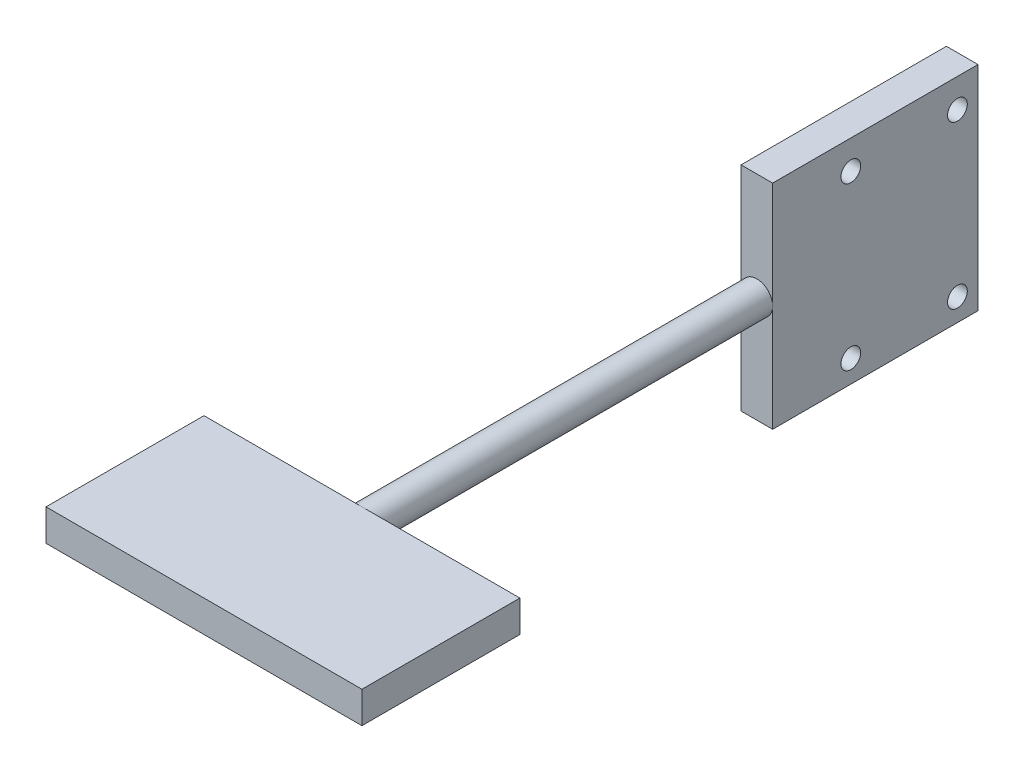
ISO-10303-21;
HEADER;
FILE_DESCRIPTION(('STEP AP214'),'2;1');
FILE_NAME('part.step','',(''),(''),'','','');
FILE_SCHEMA(('AUTOMOTIVE_DESIGN { 1 0 10303 214 1 1 1 1 }'));
ENDSEC;
DATA;
#1=APPLICATION_CONTEXT('core data for automotive mechanical design processes');
#2=APPLICATION_PROTOCOL_DEFINITION('international standard','automotive_design',2000,#1);
#3=PRODUCT_CONTEXT('',#1,'mechanical');
#4=PRODUCT('Part','Part','',(#3));
#5=PRODUCT_RELATED_PRODUCT_CATEGORY('part','',(#4));
#6=PRODUCT_DEFINITION_FORMATION('','',#4);
#7=PRODUCT_DEFINITION_CONTEXT('part definition',#1,'design');
#8=PRODUCT_DEFINITION('design','',#6,#7);
#9=PRODUCT_DEFINITION_SHAPE('','',#8);
#10=(LENGTH_UNIT() NAMED_UNIT(*) SI_UNIT(.MILLI.,.METRE.));
#11=(NAMED_UNIT(*) PLANE_ANGLE_UNIT() SI_UNIT($,.RADIAN.));
#12=(NAMED_UNIT(*) SI_UNIT($,.STERADIAN.) SOLID_ANGLE_UNIT());
#13=UNCERTAINTY_MEASURE_WITH_UNIT(LENGTH_MEASURE(1.E-05),#10,'distance_accuracy_value','');
#14=(GEOMETRIC_REPRESENTATION_CONTEXT(3) GLOBAL_UNCERTAINTY_ASSIGNED_CONTEXT((#13)) GLOBAL_UNIT_ASSIGNED_CONTEXT((#10,
#11,#12)) REPRESENTATION_CONTEXT('',''));
#15=CARTESIAN_POINT('',(0.,0.,0.));
#16=DIRECTION('',(0.,0.,1.));
#17=DIRECTION('',(1.,0.,0.));
#18=AXIS2_PLACEMENT_3D('',#15,#16,#17);
#19=CARTESIAN_POINT('',(-12.8813559322034,4.,-10.1694915254237));
#20=DIRECTION('',(0.,0.,1.));
#21=DIRECTION('',(1.,0.,0.));
#22=AXIS2_PLACEMENT_3D('',#19,#20,#21);
#23=PLANE('',#22);
#24=CARTESIAN_POINT('',(7.1186440677966,2.,-10.1694915254237));
#25=DIRECTION('',(0.,0.,-1.));
#26=DIRECTION('',(-1.,0.,0.));
#27=AXIS2_PLACEMENT_3D('',#24,#25,#26);
#28=CIRCLE('',#27,2.);
#29=CARTESIAN_POINT('',(7.1186440677966,4.,-10.1694915254237));
#30=VERTEX_POINT('',#29);
#31=CARTESIAN_POINT('',(7.1186440677966,0.,-10.1694915254237));
#32=VERTEX_POINT('',#31);
#33=EDGE_CURVE('E52',#30,#32,#28,.T.);
#34=ORIENTED_EDGE('',*,*,#33,.F.);
#35=DIRECTION('',(-1.,0.,0.));
#36=VECTOR('',#35,1.);
#37=CARTESIAN_POINT('',(-12.8813559322034,4.,-10.1694915254237));
#38=LINE('',#37,#36);
#39=CARTESIAN_POINT('',(27.1186440677966,4.,-10.1694915254237));
#40=VERTEX_POINT('',#39);
#41=EDGE_CURVE('E200',#40,#30,#38,.T.);
#42=ORIENTED_EDGE('',*,*,#41,.F.);
#43=DIRECTION('',(0.,-1.,0.));
#44=VECTOR('',#43,1.);
#45=CARTESIAN_POINT('',(27.1186440677966,4.,-10.1694915254237));
#46=LINE('',#45,#44);
#47=CARTESIAN_POINT('',(27.1186440677966,0.,-10.1694915254237));
#48=VERTEX_POINT('',#47);
#49=EDGE_CURVE('E220',#40,#48,#46,.T.);
#50=ORIENTED_EDGE('',*,*,#49,.T.);
#51=DIRECTION('',(-1.,0.,0.));
#52=VECTOR('',#51,1.);
#53=CARTESIAN_POINT('',(-12.8813559322034,0.,-10.1694915254237));
#54=LINE('',#53,#52);
#55=EDGE_CURVE('E193',#48,#32,#54,.T.);
#56=ORIENTED_EDGE('',*,*,#55,.T.);
#57=EDGE_LOOP('',(#34,#42,#50,#56));
#58=FACE_BOUND('',#57,.T.);
#59=ADVANCED_FACE('F41',(#58),#23,.F.);
#60=CARTESIAN_POINT('',(-12.8813559322034,4.,-10.1694915254237));
#61=DIRECTION('',(1.,0.,0.));
#62=DIRECTION('',(0.,0.,-1.));
#63=AXIS2_PLACEMENT_3D('',#60,#61,#62);
#64=PLANE('',#63);
#65=DIRECTION('',(0.,0.,1.));
#66=VECTOR('',#65,1.);
#67=CARTESIAN_POINT('',(-12.8813559322034,0.,-10.1694915254237));
#68=LINE('',#67,#66);
#69=CARTESIAN_POINT('',(-12.8813559322034,0.,-10.1694915254237));
#70=VERTEX_POINT('',#69);
#71=CARTESIAN_POINT('',(-12.8813559322034,0.,9.83050847457626));
#72=VERTEX_POINT('',#71);
#73=EDGE_CURVE('E184',#70,#72,#68,.T.);
#74=ORIENTED_EDGE('',*,*,#73,.T.);
#75=DIRECTION('',(0.,-1.,0.));
#76=VECTOR('',#75,1.);
#77=CARTESIAN_POINT('',(-12.8813559322034,4.,9.83050847457626));
#78=LINE('',#77,#76);
#79=CARTESIAN_POINT('',(-12.8813559322034,4.,9.83050847457626));
#80=VERTEX_POINT('',#79);
#81=EDGE_CURVE('E45',#80,#72,#78,.T.);
#82=ORIENTED_EDGE('',*,*,#81,.F.);
#83=DIRECTION('',(0.,0.,1.));
#84=VECTOR('',#83,1.);
#85=CARTESIAN_POINT('',(-12.8813559322034,4.,-10.1694915254237));
#86=LINE('',#85,#84);
#87=CARTESIAN_POINT('',(-12.8813559322034,4.,-10.1694915254237));
#88=VERTEX_POINT('',#87);
#89=EDGE_CURVE('E188',#88,#80,#86,.T.);
#90=ORIENTED_EDGE('',*,*,#89,.F.);
#91=DIRECTION('',(0.,-1.,0.));
#92=VECTOR('',#91,1.);
#93=CARTESIAN_POINT('',(-12.8813559322034,4.,-10.1694915254237));
#94=LINE('',#93,#92);
#95=EDGE_CURVE('E203',#88,#70,#94,.T.);
#96=ORIENTED_EDGE('',*,*,#95,.T.);
#97=EDGE_LOOP('',(#74,#82,#90,#96));
#98=FACE_BOUND('',#97,.T.);
#99=ADVANCED_FACE('F43',(#98),#64,.F.);
#100=CARTESIAN_POINT('',(-12.8813559322034,4.,9.83050847457626));
#101=DIRECTION('',(0.,0.,-1.));
#102=DIRECTION('',(-1.,0.,0.));
#103=AXIS2_PLACEMENT_3D('',#100,#101,#102);
#104=PLANE('',#103);
#105=DIRECTION('',(1.,0.,0.));
#106=VECTOR('',#105,1.);
#107=CARTESIAN_POINT('',(-12.8813559322034,0.,9.83050847457626));
#108=LINE('',#107,#106);
#109=CARTESIAN_POINT('',(27.1186440677966,0.,9.83050847457626));
#110=VERTEX_POINT('',#109);
#111=EDGE_CURVE('E207',#72,#110,#108,.T.);
#112=ORIENTED_EDGE('',*,*,#111,.T.);
#113=DIRECTION('',(0.,-1.,0.));
#114=VECTOR('',#113,1.);
#115=CARTESIAN_POINT('',(27.1186440677966,4.,9.83050847457626));
#116=LINE('',#115,#114);
#117=CARTESIAN_POINT('',(27.1186440677966,4.,9.83050847457626));
#118=VERTEX_POINT('',#117);
#119=EDGE_CURVE('E223',#118,#110,#116,.T.);
#120=ORIENTED_EDGE('',*,*,#119,.F.);
#121=DIRECTION('',(1.,0.,0.));
#122=VECTOR('',#121,1.);
#123=CARTESIAN_POINT('',(-12.8813559322034,4.,9.83050847457626));
#124=LINE('',#123,#122);
#125=EDGE_CURVE('E192',#80,#118,#124,.T.);
#126=ORIENTED_EDGE('',*,*,#125,.F.);
#127=ORIENTED_EDGE('',*,*,#81,.T.);
#128=EDGE_LOOP('',(#112,#120,#126,#127));
#129=FACE_BOUND('',#128,.T.);
#130=ADVANCED_FACE('F234',(#129),#104,.F.);
#131=CARTESIAN_POINT('',(27.1186440677966,4.,-10.1694915254237));
#132=DIRECTION('',(-1.,0.,0.));
#133=DIRECTION('',(0.,0.,1.));
#134=AXIS2_PLACEMENT_3D('',#131,#132,#133);
#135=PLANE('',#134);
#136=DIRECTION('',(0.,0.,-1.));
#137=VECTOR('',#136,1.);
#138=CARTESIAN_POINT('',(27.1186440677966,0.,-10.1694915254237));
#139=LINE('',#138,#137);
#140=EDGE_CURVE('E210',#110,#48,#139,.T.);
#141=ORIENTED_EDGE('',*,*,#140,.T.);
#142=ORIENTED_EDGE('',*,*,#49,.F.);
#143=DIRECTION('',(0.,0.,-1.));
#144=VECTOR('',#143,1.);
#145=CARTESIAN_POINT('',(27.1186440677966,4.,-10.1694915254237));
#146=LINE('',#145,#144);
#147=EDGE_CURVE('E196',#118,#40,#146,.T.);
#148=ORIENTED_EDGE('',*,*,#147,.F.);
#149=ORIENTED_EDGE('',*,*,#119,.T.);
#150=EDGE_LOOP('',(#141,#142,#148,#149));
#151=FACE_BOUND('',#150,.T.);
#152=ADVANCED_FACE('F243',(#151),#135,.F.);
#153=EDGE_CURVE('E11',#32,#30,#28,.T.);
#154=ORIENTED_EDGE('',*,*,#153,.F.);
#155=EDGE_CURVE('E213',#32,#70,#54,.T.);
#156=ORIENTED_EDGE('',*,*,#155,.T.);
#157=ORIENTED_EDGE('',*,*,#95,.F.);
#158=EDGE_CURVE('E199',#30,#88,#38,.T.);
#159=ORIENTED_EDGE('',*,*,#158,.F.);
#160=EDGE_LOOP('',(#154,#156,#157,#159));
#161=FACE_BOUND('',#160,.T.);
#162=ADVANCED_FACE('F249',(#161),#23,.F.);
#163=CARTESIAN_POINT('',(0.,4.,0.));
#164=DIRECTION('',(0.,1.,0.));
#165=DIRECTION('',(0.,0.,1.));
#166=AXIS2_PLACEMENT_3D('',#163,#164,#165);
#167=PLANE('',#166);
#168=ORIENTED_EDGE('',*,*,#89,.T.);
#169=ORIENTED_EDGE('',*,*,#125,.T.);
#170=ORIENTED_EDGE('',*,*,#147,.T.);
#171=ORIENTED_EDGE('',*,*,#41,.T.);
#172=ORIENTED_EDGE('',*,*,#158,.T.);
#173=EDGE_LOOP('',(#168,#169,#170,#171,#172));
#174=FACE_BOUND('',#173,.T.);
#175=ADVANCED_FACE('F248',(#174),#167,.T.);
#176=CARTESIAN_POINT('',(0.,0.,0.));
#177=DIRECTION('',(0.,1.,0.));
#178=DIRECTION('',(0.,0.,1.));
#179=AXIS2_PLACEMENT_3D('',#176,#177,#178);
#180=PLANE('',#179);
#181=ORIENTED_EDGE('',*,*,#73,.F.);
#182=ORIENTED_EDGE('',*,*,#155,.F.);
#183=ORIENTED_EDGE('',*,*,#55,.F.);
#184=ORIENTED_EDGE('',*,*,#140,.F.);
#185=ORIENTED_EDGE('',*,*,#111,.F.);
#186=EDGE_LOOP('',(#181,#182,#183,#184,#185));
#187=FACE_BOUND('',#186,.T.);
#188=ADVANCED_FACE('F240',(#187),#180,.F.);
#189=CARTESIAN_POINT('',(7.1186440677966,2.,-60.1694915254237));
#190=DIRECTION('',(0.,0.,1.));
#191=DIRECTION('',(1.,0.,0.));
#192=AXIS2_PLACEMENT_3D('',#189,#190,#191);
#193=CYLINDRICAL_SURFACE('',#192,2.);
#194=CARTESIAN_POINT('',(7.1186440677966,2.,-60.1694915254237));
#195=DIRECTION('',(0.,0.,-1.));
#196=DIRECTION('',(-1.,0.,0.));
#197=AXIS2_PLACEMENT_3D('',#194,#195,#196);
#198=CIRCLE('',#197,2.);
#199=CARTESIAN_POINT('',(5.1186440677966,2.,-60.1694915254237));
#200=VERTEX_POINT('',#199);
#201=CARTESIAN_POINT('',(9.1186440677966,2.,-60.1694915254237));
#202=VERTEX_POINT('',#201);
#203=EDGE_CURVE('E182',#200,#202,#198,.T.);
#204=ORIENTED_EDGE('',*,*,#203,.F.);
#205=EDGE_CURVE('E58',#202,#200,#198,.T.);
#206=ORIENTED_EDGE('',*,*,#205,.F.);
#207=EDGE_LOOP('',(#204,#206));
#208=FACE_BOUND('',#207,.T.);
#209=ORIENTED_EDGE('',*,*,#33,.T.);
#210=ORIENTED_EDGE('',*,*,#153,.T.);
#211=EDGE_LOOP('',(#209,#210));
#212=FACE_BOUND('',#211,.T.);
#213=ADVANCED_FACE('F324',(#208,#212),#193,.T.);
#214=CARTESIAN_POINT('',(9.1186440677966,0.,-60.1694915254237));
#215=DIRECTION('',(0.,0.,1.));
#216=DIRECTION('',(1.,0.,0.));
#217=AXIS2_PLACEMENT_3D('',#214,#215,#216);
#218=PLANE('',#217);
#219=DIRECTION('',(-1.,0.,0.));
#220=VECTOR('',#219,1.);
#221=CARTESIAN_POINT('',(9.1186440677966,15.5,-60.1694915254237));
#222=LINE('',#221,#220);
#223=CARTESIAN_POINT('',(9.1186440677966,15.5,-60.1694915254237));
#224=VERTEX_POINT('',#223);
#225=CARTESIAN_POINT('',(5.1186440677966,15.5,-60.1694915254237));
#226=VERTEX_POINT('',#225);
#227=EDGE_CURVE('E174',#224,#226,#222,.T.);
#228=ORIENTED_EDGE('',*,*,#227,.T.);
#229=DIRECTION('',(0.,1.,0.));
#230=VECTOR('',#229,1.);
#231=CARTESIAN_POINT('',(5.1186440677966,-11.5,-60.1694915254237));
#232=LINE('',#231,#230);
#233=EDGE_CURVE('E140',#200,#226,#232,.T.);
#234=ORIENTED_EDGE('',*,*,#233,.F.);
#235=ORIENTED_EDGE('',*,*,#203,.T.);
#236=DIRECTION('',(0.,1.,0.));
#237=VECTOR('',#236,1.);
#238=CARTESIAN_POINT('',(9.1186440677966,0.,-60.1694915254237));
#239=LINE('',#238,#237);
#240=EDGE_CURVE('E161',#202,#224,#239,.T.);
#241=ORIENTED_EDGE('',*,*,#240,.T.);
#242=EDGE_LOOP('',(#228,#234,#235,#241));
#243=FACE_BOUND('',#242,.T.);
#244=ADVANCED_FACE('F257',(#243),#218,.T.);
#245=CARTESIAN_POINT('',(9.1186440677966,-11.5,-60.1694915254237));
#246=VERTEX_POINT('',#245);
#247=EDGE_CURVE('E162',#246,#202,#239,.T.);
#248=ORIENTED_EDGE('',*,*,#247,.T.);
#249=ORIENTED_EDGE('',*,*,#205,.T.);
#250=CARTESIAN_POINT('',(5.1186440677966,-11.5,-60.1694915254237));
#251=VERTEX_POINT('',#250);
#252=EDGE_CURVE('E134',#251,#200,#232,.T.);
#253=ORIENTED_EDGE('',*,*,#252,.F.);
#254=DIRECTION('',(-1.,0.,0.));
#255=VECTOR('',#254,1.);
#256=CARTESIAN_POINT('',(9.1186440677966,-11.5,-60.1694915254237));
#257=LINE('',#256,#255);
#258=EDGE_CURVE('E120',#246,#251,#257,.T.);
#259=ORIENTED_EDGE('',*,*,#258,.F.);
#260=EDGE_LOOP('',(#248,#249,#253,#259));
#261=FACE_BOUND('',#260,.T.);
#262=ADVANCED_FACE('F135',(#261),#218,.T.);
#263=CARTESIAN_POINT('',(9.1186440677966,-11.5,0.));
#264=DIRECTION('',(0.,1.,0.));
#265=DIRECTION('',(0.,0.,1.));
#266=AXIS2_PLACEMENT_3D('',#263,#264,#265);
#267=PLANE('',#266);
#268=ORIENTED_EDGE('',*,*,#258,.T.);
#269=DIRECTION('',(0.,0.,1.));
#270=VECTOR('',#269,1.);
#271=CARTESIAN_POINT('',(5.1186440677966,-11.5,-86.1694915254237));
#272=LINE('',#271,#270);
#273=CARTESIAN_POINT('',(5.1186440677966,-11.5,-86.1694915254237));
#274=VERTEX_POINT('',#273);
#275=EDGE_CURVE('E125',#274,#251,#272,.T.);
#276=ORIENTED_EDGE('',*,*,#275,.F.);
#277=DIRECTION('',(-1.,0.,0.));
#278=VECTOR('',#277,1.);
#279=CARTESIAN_POINT('',(9.1186440677966,-11.5,-86.1694915254237));
#280=LINE('',#279,#278);
#281=CARTESIAN_POINT('',(9.1186440677966,-11.5,-86.1694915254237));
#282=VERTEX_POINT('',#281);
#283=EDGE_CURVE('E131',#282,#274,#280,.T.);
#284=ORIENTED_EDGE('',*,*,#283,.F.);
#285=DIRECTION('',(0.,0.,-1.));
#286=VECTOR('',#285,1.);
#287=CARTESIAN_POINT('',(9.1186440677966,-11.5,0.));
#288=LINE('',#287,#286);
#289=EDGE_CURVE('E126',#246,#282,#288,.T.);
#290=ORIENTED_EDGE('',*,*,#289,.F.);
#291=EDGE_LOOP('',(#268,#276,#284,#290));
#292=FACE_BOUND('',#291,.T.);
#293=ADVANCED_FACE('F122',(#292),#267,.F.);
#294=CARTESIAN_POINT('',(9.1186440677966,0.,-86.1694915254237));
#295=DIRECTION('',(0.,0.,1.));
#296=DIRECTION('',(1.,0.,0.));
#297=AXIS2_PLACEMENT_3D('',#294,#295,#296);
#298=PLANE('',#297);
#299=ORIENTED_EDGE('',*,*,#283,.T.);
#300=DIRECTION('',(0.,-1.,0.));
#301=VECTOR('',#300,1.);
#302=CARTESIAN_POINT('',(5.1186440677966,15.5,-86.1694915254237));
#303=LINE('',#302,#301);
#304=CARTESIAN_POINT('',(5.1186440677966,15.5,-86.1694915254237));
#305=VERTEX_POINT('',#304);
#306=EDGE_CURVE('E146',#305,#274,#303,.T.);
#307=ORIENTED_EDGE('',*,*,#306,.F.);
#308=DIRECTION('',(-1.,0.,0.));
#309=VECTOR('',#308,1.);
#310=CARTESIAN_POINT('',(9.1186440677966,15.5,-86.1694915254237));
#311=LINE('',#310,#309);
#312=CARTESIAN_POINT('',(9.1186440677966,15.5,-86.1694915254237));
#313=VERTEX_POINT('',#312);
#314=EDGE_CURVE('E177',#313,#305,#311,.T.);
#315=ORIENTED_EDGE('',*,*,#314,.F.);
#316=DIRECTION('',(0.,1.,0.));
#317=VECTOR('',#316,1.);
#318=CARTESIAN_POINT('',(9.1186440677966,0.,-86.1694915254237));
#319=LINE('',#318,#317);
#320=EDGE_CURVE('E167',#282,#313,#319,.T.);
#321=ORIENTED_EDGE('',*,*,#320,.F.);
#322=EDGE_LOOP('',(#299,#307,#315,#321));
#323=FACE_BOUND('',#322,.T.);
#324=ADVANCED_FACE('F268',(#323),#298,.F.);
#325=CARTESIAN_POINT('',(9.1186440677966,15.5,0.));
#326=DIRECTION('',(0.,1.,0.));
#327=DIRECTION('',(0.,0.,1.));
#328=AXIS2_PLACEMENT_3D('',#325,#326,#327);
#329=PLANE('',#328);
#330=ORIENTED_EDGE('',*,*,#314,.T.);
#331=DIRECTION('',(0.,0.,-1.));
#332=VECTOR('',#331,1.);
#333=CARTESIAN_POINT('',(5.1186440677966,15.5,-60.1694915254237));
#334=LINE('',#333,#332);
#335=EDGE_CURVE('E139',#226,#305,#334,.T.);
#336=ORIENTED_EDGE('',*,*,#335,.F.);
#337=ORIENTED_EDGE('',*,*,#227,.F.);
#338=DIRECTION('',(0.,0.,-1.));
#339=VECTOR('',#338,1.);
#340=CARTESIAN_POINT('',(9.1186440677966,15.5,0.));
#341=LINE('',#340,#339);
#342=EDGE_CURVE('E170',#224,#313,#341,.T.);
#343=ORIENTED_EDGE('',*,*,#342,.T.);
#344=EDGE_LOOP('',(#330,#336,#337,#343));
#345=FACE_BOUND('',#344,.T.);
#346=ADVANCED_FACE('F263',(#345),#329,.T.);
#347=CARTESIAN_POINT('',(9.1186440677966,0.,0.));
#348=DIRECTION('',(1.,0.,0.));
#349=DIRECTION('',(0.,0.,-1.));
#350=AXIS2_PLACEMENT_3D('',#347,#348,#349);
#351=PLANE('',#350);
#352=CARTESIAN_POINT('',(9.1186440677966,-8.65497970092844,-83.5649553489628));
#353=DIRECTION('',(1.,0.,0.));
#354=DIRECTION('',(0.,0.,-1.));
#355=AXIS2_PLACEMENT_3D('',#352,#353,#354);
#356=CIRCLE('',#355,1.25000000000091);
#357=CARTESIAN_POINT('',(9.1186440677966,-8.65497970092844,-84.8149553489637));
#358=VERTEX_POINT('',#357);
#359=EDGE_CURVE('E148',#358,#358,#356,.T.);
#360=ORIENTED_EDGE('',*,*,#359,.F.);
#361=EDGE_LOOP('',(#360));
#362=FACE_BOUND('',#361,.T.);
#363=CARTESIAN_POINT('',(9.1186440677966,-8.6549797009284,-70.0649553489628));
#364=DIRECTION('',(1.,0.,0.));
#365=DIRECTION('',(0.,0.,-1.));
#366=AXIS2_PLACEMENT_3D('',#363,#364,#365);
#367=CIRCLE('',#366,1.25);
#368=CARTESIAN_POINT('',(9.1186440677966,-8.6549797009284,-71.3149553489628));
#369=VERTEX_POINT('',#368);
#370=EDGE_CURVE('E153',#369,#369,#367,.T.);
#371=ORIENTED_EDGE('',*,*,#370,.F.);
#372=EDGE_LOOP('',(#371));
#373=FACE_BOUND('',#372,.T.);
#374=CARTESIAN_POINT('',(9.1186440677966,11.8450202990716,-70.0649553489628));
#375=DIRECTION('',(1.,0.,0.));
#376=DIRECTION('',(0.,0.,-1.));
#377=AXIS2_PLACEMENT_3D('',#374,#375,#376);
#378=CIRCLE('',#377,1.24999999999999);
#379=CARTESIAN_POINT('',(9.1186440677966,11.8450202990716,-71.3149553489628));
#380=VERTEX_POINT('',#379);
#381=EDGE_CURVE('E469',#380,#380,#378,.T.);
#382=ORIENTED_EDGE('',*,*,#381,.F.);
#383=EDGE_LOOP('',(#382));
#384=FACE_BOUND('',#383,.T.);
#385=CARTESIAN_POINT('',(9.1186440677966,11.8450202990716,-83.5649553489628));
#386=DIRECTION('',(1.,0.,0.));
#387=DIRECTION('',(0.,0.,-1.));
#388=AXIS2_PLACEMENT_3D('',#385,#386,#387);
#389=CIRCLE('',#388,1.25);
#390=CARTESIAN_POINT('',(9.1186440677966,11.8450202990716,-84.8149553489628));
#391=VERTEX_POINT('',#390);
#392=EDGE_CURVE('E465',#391,#391,#389,.T.);
#393=ORIENTED_EDGE('',*,*,#392,.F.);
#394=EDGE_LOOP('',(#393));
#395=FACE_BOUND('',#394,.T.);
#396=ORIENTED_EDGE('',*,*,#247,.F.);
#397=ORIENTED_EDGE('',*,*,#289,.T.);
#398=ORIENTED_EDGE('',*,*,#320,.T.);
#399=ORIENTED_EDGE('',*,*,#342,.F.);
#400=ORIENTED_EDGE('',*,*,#240,.F.);
#401=EDGE_LOOP('',(#396,#397,#398,#399,#400));
#402=FACE_BOUND('',#401,.T.);
#403=ADVANCED_FACE('F264',(#362,#373,#384,#395,#402),#351,.T.);
#404=CARTESIAN_POINT('',(5.1186440677966,0.,0.));
#405=DIRECTION('',(-1.,0.,0.));
#406=DIRECTION('',(0.,0.,1.));
#407=AXIS2_PLACEMENT_3D('',#404,#405,#406);
#408=PLANE('',#407);
#409=CARTESIAN_POINT('',(5.1186440677966,-8.65497970092844,-83.5649553489628));
#410=DIRECTION('',(-1.,0.,0.));
#411=DIRECTION('',(0.,0.,1.));
#412=AXIS2_PLACEMENT_3D('',#409,#410,#411);
#413=CIRCLE('',#412,1.25000000000091);
#414=CARTESIAN_POINT('',(5.1186440677966,-8.65497970092844,-82.3149553489619));
#415=VERTEX_POINT('',#414);
#416=EDGE_CURVE('E451',#415,#415,#413,.T.);
#417=ORIENTED_EDGE('',*,*,#416,.F.);
#418=EDGE_LOOP('',(#417));
#419=FACE_BOUND('',#418,.T.);
#420=CARTESIAN_POINT('',(5.1186440677966,-8.6549797009284,-70.0649553489628));
#421=DIRECTION('',(-1.,0.,0.));
#422=DIRECTION('',(0.,0.,1.));
#423=AXIS2_PLACEMENT_3D('',#420,#421,#422);
#424=CIRCLE('',#423,1.25);
#425=CARTESIAN_POINT('',(5.1186440677966,-8.6549797009284,-68.8149553489628));
#426=VERTEX_POINT('',#425);
#427=EDGE_CURVE('E453',#426,#426,#424,.T.);
#428=ORIENTED_EDGE('',*,*,#427,.F.);
#429=EDGE_LOOP('',(#428));
#430=FACE_BOUND('',#429,.T.);
#431=CARTESIAN_POINT('',(5.1186440677966,11.8450202990716,-70.0649553489628));
#432=DIRECTION('',(-1.,0.,0.));
#433=DIRECTION('',(0.,0.,1.));
#434=AXIS2_PLACEMENT_3D('',#431,#432,#433);
#435=CIRCLE('',#434,1.24999999999999);
#436=CARTESIAN_POINT('',(5.1186440677966,11.8450202990716,-68.8149553489628));
#437=VERTEX_POINT('',#436);
#438=EDGE_CURVE('E457',#437,#437,#435,.T.);
#439=ORIENTED_EDGE('',*,*,#438,.F.);
#440=EDGE_LOOP('',(#439));
#441=FACE_BOUND('',#440,.T.);
#442=CARTESIAN_POINT('',(5.1186440677966,11.8450202990716,-83.5649553489628));
#443=DIRECTION('',(-1.,0.,0.));
#444=DIRECTION('',(0.,0.,1.));
#445=AXIS2_PLACEMENT_3D('',#442,#443,#444);
#446=CIRCLE('',#445,1.25);
#447=CARTESIAN_POINT('',(5.1186440677966,11.8450202990716,-82.3149553489628));
#448=VERTEX_POINT('',#447);
#449=EDGE_CURVE('E461',#448,#448,#446,.T.);
#450=ORIENTED_EDGE('',*,*,#449,.F.);
#451=EDGE_LOOP('',(#450));
#452=FACE_BOUND('',#451,.T.);
#453=ORIENTED_EDGE('',*,*,#275,.T.);
#454=ORIENTED_EDGE('',*,*,#252,.T.);
#455=ORIENTED_EDGE('',*,*,#233,.T.);
#456=ORIENTED_EDGE('',*,*,#335,.T.);
#457=ORIENTED_EDGE('',*,*,#306,.T.);
#458=EDGE_LOOP('',(#453,#454,#455,#456,#457));
#459=FACE_BOUND('',#458,.T.);
#460=ADVANCED_FACE('F143',(#419,#430,#441,#452,#459),#408,.T.);
#461=CARTESIAN_POINT('',(27.1186440677966,11.8450202990716,-83.5649553489628));
#462=DIRECTION('',(-1.,0.,0.));
#463=DIRECTION('',(0.,0.,1.));
#464=AXIS2_PLACEMENT_3D('',#461,#462,#463);
#465=CYLINDRICAL_SURFACE('',#464,1.25);
#466=ORIENTED_EDGE('',*,*,#392,.T.);
#467=EDGE_LOOP('',(#466));
#468=FACE_BOUND('',#467,.T.);
#469=ORIENTED_EDGE('',*,*,#449,.T.);
#470=EDGE_LOOP('',(#469));
#471=FACE_BOUND('',#470,.T.);
#472=ADVANCED_FACE('F403',(#468,#471),#465,.F.);
#473=CARTESIAN_POINT('',(27.1186440677966,11.8450202990716,-70.0649553489628));
#474=DIRECTION('',(-1.,0.,0.));
#475=DIRECTION('',(0.,0.,1.));
#476=AXIS2_PLACEMENT_3D('',#473,#474,#475);
#477=CYLINDRICAL_SURFACE('',#476,1.24999999999999);
#478=ORIENTED_EDGE('',*,*,#381,.T.);
#479=EDGE_LOOP('',(#478));
#480=FACE_BOUND('',#479,.T.);
#481=ORIENTED_EDGE('',*,*,#438,.T.);
#482=EDGE_LOOP('',(#481));
#483=FACE_BOUND('',#482,.T.);
#484=ADVANCED_FACE('F413',(#480,#483),#477,.F.);
#485=CARTESIAN_POINT('',(27.1186440677966,-8.6549797009284,-70.0649553489628));
#486=DIRECTION('',(-1.,0.,0.));
#487=DIRECTION('',(0.,0.,1.));
#488=AXIS2_PLACEMENT_3D('',#485,#486,#487);
#489=CYLINDRICAL_SURFACE('',#488,1.25);
#490=ORIENTED_EDGE('',*,*,#370,.T.);
#491=EDGE_LOOP('',(#490));
#492=FACE_BOUND('',#491,.T.);
#493=ORIENTED_EDGE('',*,*,#427,.T.);
#494=EDGE_LOOP('',(#493));
#495=FACE_BOUND('',#494,.T.);
#496=ADVANCED_FACE('F423',(#492,#495),#489,.F.);
#497=CARTESIAN_POINT('',(27.1186440677966,-8.65497970092844,-83.5649553489628));
#498=DIRECTION('',(-1.,0.,0.));
#499=DIRECTION('',(0.,0.,1.));
#500=AXIS2_PLACEMENT_3D('',#497,#498,#499);
#501=CYLINDRICAL_SURFACE('',#500,1.25000000000091);
#502=ORIENTED_EDGE('',*,*,#359,.T.);
#503=EDGE_LOOP('',(#502));
#504=FACE_BOUND('',#503,.T.);
#505=ORIENTED_EDGE('',*,*,#416,.T.);
#506=EDGE_LOOP('',(#505));
#507=FACE_BOUND('',#506,.T.);
#508=ADVANCED_FACE('F433',(#504,#507),#501,.F.);
#509=CLOSED_SHELL('',(#59,#99,#130,#152,#162,#175,#188,#213,#244,#262,#293,#324,#346,#403,#460,
#472,#484,#496,#508));
#510=MANIFOLD_SOLID_BREP('B2',#509);
#511=ADVANCED_BREP_SHAPE_REPRESENTATION('',(#18,#510),#14);
#512=SHAPE_DEFINITION_REPRESENTATION(#9,#511);
ENDSEC;
END-ISO-10303-21;
